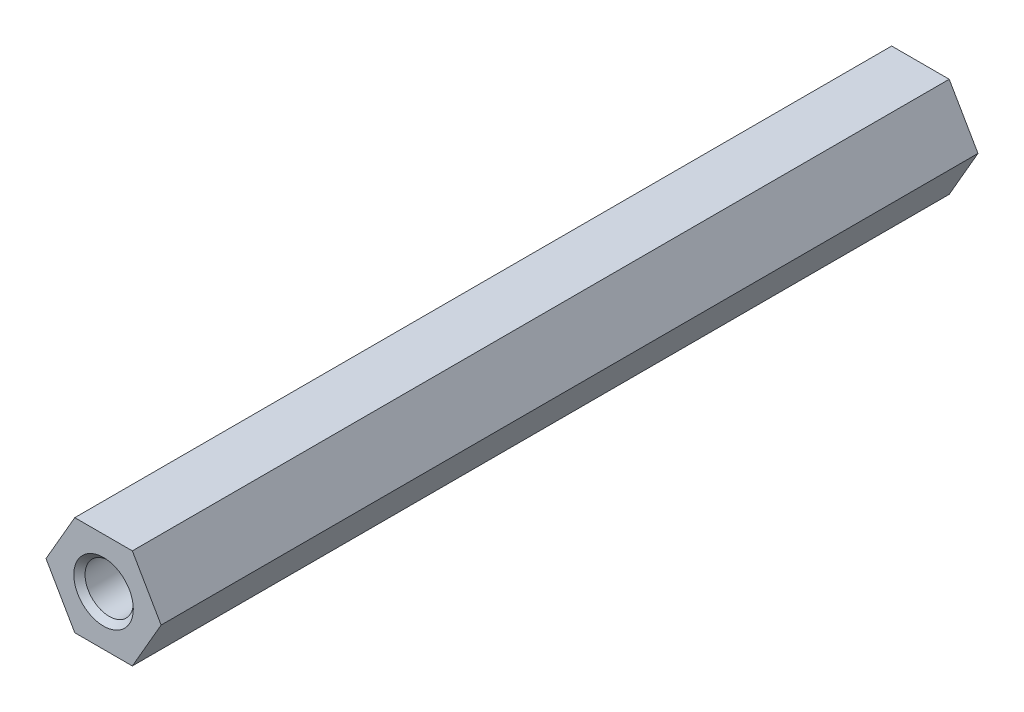
ISO-10303-21;
HEADER;
FILE_DESCRIPTION(('STEP AP214'),'2;1');
FILE_NAME('part.step','',(''),(''),'','','');
FILE_SCHEMA(('AUTOMOTIVE_DESIGN { 1 0 10303 214 1 1 1 1 }'));
ENDSEC;
DATA;
#1=APPLICATION_CONTEXT('core data for automotive mechanical design processes');
#2=APPLICATION_PROTOCOL_DEFINITION('international standard','automotive_design',2000,#1);
#3=PRODUCT_CONTEXT('',#1,'mechanical');
#4=PRODUCT('Part','Part','',(#3));
#5=PRODUCT_RELATED_PRODUCT_CATEGORY('part','',(#4));
#6=PRODUCT_DEFINITION_FORMATION('','',#4);
#7=PRODUCT_DEFINITION_CONTEXT('part definition',#1,'design');
#8=PRODUCT_DEFINITION('design','',#6,#7);
#9=PRODUCT_DEFINITION_SHAPE('','',#8);
#10=(LENGTH_UNIT() NAMED_UNIT(*) SI_UNIT(.MILLI.,.METRE.));
#11=(NAMED_UNIT(*) PLANE_ANGLE_UNIT() SI_UNIT($,.RADIAN.));
#12=(NAMED_UNIT(*) SI_UNIT($,.STERADIAN.) SOLID_ANGLE_UNIT());
#13=UNCERTAINTY_MEASURE_WITH_UNIT(LENGTH_MEASURE(1.E-05),#10,'distance_accuracy_value','');
#14=(GEOMETRIC_REPRESENTATION_CONTEXT(3) GLOBAL_UNCERTAINTY_ASSIGNED_CONTEXT((#13)) GLOBAL_UNIT_ASSIGNED_CONTEXT((#10,
#11,#12)) REPRESENTATION_CONTEXT('',''));
#15=CARTESIAN_POINT('',(0.,0.,0.));
#16=DIRECTION('',(0.,0.,1.));
#17=DIRECTION('',(1.,0.,0.));
#18=AXIS2_PLACEMENT_3D('',#15,#16,#17);
#19=CARTESIAN_POINT('',(-1.78978583448784,-3.1,0.));
#20=DIRECTION('',(0.,-1.,0.));
#21=DIRECTION('',(0.,0.,-1.));
#22=AXIS2_PLACEMENT_3D('',#19,#20,#21);
#23=PLANE('',#22);
#24=DIRECTION('',(0.,0.,1.));
#25=VECTOR('',#24,1.);
#26=CARTESIAN_POINT('',(-1.78978583448784,-3.1,0.));
#27=LINE('',#26,#25);
#28=CARTESIAN_POINT('',(-1.78978583448784,-3.1,0.));
#29=VERTEX_POINT('',#28);
#30=CARTESIAN_POINT('',(-1.78978583448784,-3.1,50.8));
#31=VERTEX_POINT('',#30);
#32=EDGE_CURVE('E100',#29,#31,#27,.T.);
#33=ORIENTED_EDGE('',*,*,#32,.F.);
#34=DIRECTION('',(1.,0.,0.));
#35=VECTOR('',#34,1.);
#36=CARTESIAN_POINT('',(0.,-3.1,0.));
#37=LINE('',#36,#35);
#38=CARTESIAN_POINT('',(1.78978583448784,-3.1,0.));
#39=VERTEX_POINT('',#38);
#40=EDGE_CURVE('E126',#29,#39,#37,.T.);
#41=ORIENTED_EDGE('',*,*,#40,.T.);
#42=DIRECTION('',(0.,0.,1.));
#43=VECTOR('',#42,1.);
#44=CARTESIAN_POINT('',(1.78978583448784,-3.1,0.));
#45=LINE('',#44,#43);
#46=CARTESIAN_POINT('',(1.78978583448784,-3.1,50.8));
#47=VERTEX_POINT('',#46);
#48=EDGE_CURVE('E66',#47,#39,#45,.F.);
#49=ORIENTED_EDGE('',*,*,#48,.F.);
#50=DIRECTION('',(1.,0.,0.));
#51=VECTOR('',#50,1.);
#52=CARTESIAN_POINT('',(0.,-3.1,50.8));
#53=LINE('',#52,#51);
#54=EDGE_CURVE('E78',#31,#47,#53,.T.);
#55=ORIENTED_EDGE('',*,*,#54,.F.);
#56=EDGE_LOOP('',(#33,#41,#49,#55));
#57=FACE_BOUND('',#56,.T.);
#58=ADVANCED_FACE('F15',(#57),#23,.T.);
#59=CARTESIAN_POINT('',(1.78978583448784,-3.1,0.));
#60=DIRECTION('',(0.866025403784439,-0.5,0.));
#61=DIRECTION('',(0.5,0.866025403784439,0.));
#62=AXIS2_PLACEMENT_3D('',#59,#60,#61);
#63=PLANE('',#62);
#64=ORIENTED_EDGE('',*,*,#48,.T.);
#65=DIRECTION('',(0.5,0.866025403784439,0.));
#66=VECTOR('',#65,1.);
#67=CARTESIAN_POINT('',(1.78978583448784,-3.1,0.));
#68=LINE('',#67,#66);
#69=CARTESIAN_POINT('',(3.57957166897568,0.,0.));
#70=VERTEX_POINT('',#69);
#71=EDGE_CURVE('E85',#39,#70,#68,.T.);
#72=ORIENTED_EDGE('',*,*,#71,.T.);
#73=DIRECTION('',(0.,0.,1.));
#74=VECTOR('',#73,1.);
#75=CARTESIAN_POINT('',(3.57957166897568,0.,0.));
#76=LINE('',#75,#74);
#77=CARTESIAN_POINT('',(3.57957166897568,0.,50.8));
#78=VERTEX_POINT('',#77);
#79=EDGE_CURVE('E82',#78,#70,#76,.F.);
#80=ORIENTED_EDGE('',*,*,#79,.F.);
#81=DIRECTION('',(0.5,0.866025403784439,0.));
#82=VECTOR('',#81,1.);
#83=CARTESIAN_POINT('',(1.78978583448784,-3.1,50.8));
#84=LINE('',#83,#82);
#85=EDGE_CURVE('E71',#47,#78,#84,.T.);
#86=ORIENTED_EDGE('',*,*,#85,.F.);
#87=EDGE_LOOP('',(#64,#72,#80,#86));
#88=FACE_BOUND('',#87,.T.);
#89=ADVANCED_FACE('F83',(#88),#63,.T.);
#90=CARTESIAN_POINT('',(3.57957166897568,0.,0.));
#91=DIRECTION('',(0.866025403784439,0.5,0.));
#92=DIRECTION('',(-0.5,0.866025403784439,0.));
#93=AXIS2_PLACEMENT_3D('',#90,#91,#92);
#94=PLANE('',#93);
#95=ORIENTED_EDGE('',*,*,#79,.T.);
#96=DIRECTION('',(-0.5,0.866025403784438,0.));
#97=VECTOR('',#96,1.);
#98=CARTESIAN_POINT('',(3.57957166897568,0.,0.));
#99=LINE('',#98,#97);
#100=CARTESIAN_POINT('',(1.78978583448784,3.1,0.));
#101=VERTEX_POINT('',#100);
#102=EDGE_CURVE('E123',#70,#101,#99,.T.);
#103=ORIENTED_EDGE('',*,*,#102,.T.);
#104=DIRECTION('',(0.,0.,1.));
#105=VECTOR('',#104,1.);
#106=CARTESIAN_POINT('',(1.78978583448784,3.1,0.));
#107=LINE('',#106,#105);
#108=CARTESIAN_POINT('',(1.78978583448784,3.1,50.8));
#109=VERTEX_POINT('',#108);
#110=EDGE_CURVE('E89',#109,#101,#107,.F.);
#111=ORIENTED_EDGE('',*,*,#110,.F.);
#112=DIRECTION('',(-0.5,0.866025403784438,0.));
#113=VECTOR('',#112,1.);
#114=CARTESIAN_POINT('',(3.57957166897568,0.,50.8));
#115=LINE('',#114,#113);
#116=EDGE_CURVE('E76',#78,#109,#115,.T.);
#117=ORIENTED_EDGE('',*,*,#116,.F.);
#118=EDGE_LOOP('',(#95,#103,#111,#117));
#119=FACE_BOUND('',#118,.T.);
#120=ADVANCED_FACE('F91',(#119),#94,.T.);
#121=CARTESIAN_POINT('',(1.78978583448784,3.1,0.));
#122=DIRECTION('',(0.,1.,0.));
#123=DIRECTION('',(0.,0.,1.));
#124=AXIS2_PLACEMENT_3D('',#121,#122,#123);
#125=PLANE('',#124);
#126=ORIENTED_EDGE('',*,*,#110,.T.);
#127=DIRECTION('',(1.,0.,0.));
#128=VECTOR('',#127,1.);
#129=CARTESIAN_POINT('',(0.,3.1,0.));
#130=LINE('',#129,#128);
#131=CARTESIAN_POINT('',(-1.78978583448784,3.1,0.));
#132=VERTEX_POINT('',#131);
#133=EDGE_CURVE('E118',#101,#132,#130,.F.);
#134=ORIENTED_EDGE('',*,*,#133,.T.);
#135=DIRECTION('',(0.,0.,1.));
#136=VECTOR('',#135,1.);
#137=CARTESIAN_POINT('',(-1.78978583448784,3.1,0.));
#138=LINE('',#137,#136);
#139=CARTESIAN_POINT('',(-1.78978583448784,3.1,50.8));
#140=VERTEX_POINT('',#139);
#141=EDGE_CURVE('E102',#140,#132,#138,.F.);
#142=ORIENTED_EDGE('',*,*,#141,.F.);
#143=DIRECTION('',(1.,0.,0.));
#144=VECTOR('',#143,1.);
#145=CARTESIAN_POINT('',(0.,3.1,50.8));
#146=LINE('',#145,#144);
#147=EDGE_CURVE('E93',#109,#140,#146,.F.);
#148=ORIENTED_EDGE('',*,*,#147,.F.);
#149=EDGE_LOOP('',(#126,#134,#142,#148));
#150=FACE_BOUND('',#149,.T.);
#151=ADVANCED_FACE('F141',(#150),#125,.T.);
#152=CARTESIAN_POINT('',(-1.78978583448784,3.1,0.));
#153=DIRECTION('',(-0.866025403784439,0.5,0.));
#154=DIRECTION('',(-0.5,-0.866025403784439,0.));
#155=AXIS2_PLACEMENT_3D('',#152,#153,#154);
#156=PLANE('',#155);
#157=ORIENTED_EDGE('',*,*,#141,.T.);
#158=DIRECTION('',(-0.5,-0.866025403784439,0.));
#159=VECTOR('',#158,1.);
#160=CARTESIAN_POINT('',(-1.78978583448784,3.1,0.));
#161=LINE('',#160,#159);
#162=CARTESIAN_POINT('',(-3.57957166897568,0.,0.));
#163=VERTEX_POINT('',#162);
#164=EDGE_CURVE('E115',#132,#163,#161,.T.);
#165=ORIENTED_EDGE('',*,*,#164,.T.);
#166=DIRECTION('',(0.,0.,1.));
#167=VECTOR('',#166,1.);
#168=CARTESIAN_POINT('',(-3.57957166897568,0.,0.));
#169=LINE('',#168,#167);
#170=CARTESIAN_POINT('',(-3.57957166897568,0.,50.8));
#171=VERTEX_POINT('',#170);
#172=EDGE_CURVE('E33',#171,#163,#169,.F.);
#173=ORIENTED_EDGE('',*,*,#172,.F.);
#174=DIRECTION('',(-0.5,-0.866025403784439,0.));
#175=VECTOR('',#174,1.);
#176=CARTESIAN_POINT('',(-1.78978583448784,3.1,50.8));
#177=LINE('',#176,#175);
#178=EDGE_CURVE('E95',#140,#171,#177,.T.);
#179=ORIENTED_EDGE('',*,*,#178,.F.);
#180=EDGE_LOOP('',(#157,#165,#173,#179));
#181=FACE_BOUND('',#180,.T.);
#182=ADVANCED_FACE('F133',(#181),#156,.T.);
#183=CARTESIAN_POINT('',(-3.57957166897568,0.,0.));
#184=DIRECTION('',(-0.866025403784439,-0.5,0.));
#185=DIRECTION('',(0.5,-0.866025403784439,0.));
#186=AXIS2_PLACEMENT_3D('',#183,#184,#185);
#187=PLANE('',#186);
#188=ORIENTED_EDGE('',*,*,#172,.T.);
#189=DIRECTION('',(0.5,-0.866025403784438,0.));
#190=VECTOR('',#189,1.);
#191=CARTESIAN_POINT('',(-3.57957166897568,0.,0.));
#192=LINE('',#191,#190);
#193=EDGE_CURVE('E112',#163,#29,#192,.T.);
#194=ORIENTED_EDGE('',*,*,#193,.T.);
#195=ORIENTED_EDGE('',*,*,#32,.T.);
#196=DIRECTION('',(0.5,-0.866025403784438,0.));
#197=VECTOR('',#196,1.);
#198=CARTESIAN_POINT('',(-3.57957166897568,0.,50.8));
#199=LINE('',#198,#197);
#200=EDGE_CURVE('E129',#171,#31,#199,.T.);
#201=ORIENTED_EDGE('',*,*,#200,.F.);
#202=EDGE_LOOP('',(#188,#194,#195,#201));
#203=FACE_BOUND('',#202,.T.);
#204=ADVANCED_FACE('F135',(#203),#187,.T.);
#205=CARTESIAN_POINT('',(0.,0.,50.8));
#206=DIRECTION('',(0.,0.,1.));
#207=DIRECTION('',(1.,0.,0.));
#208=AXIS2_PLACEMENT_3D('',#205,#206,#207);
#209=PLANE('',#208);
#210=CARTESIAN_POINT('',(0.,0.,50.7999999900619));
#211=DIRECTION('',(0.,0.,1.));
#212=DIRECTION('',(1.,0.,0.));
#213=AXIS2_PLACEMENT_3D('',#210,#211,#212);
#214=CIRCLE('',#213,1.84999999001436);
#215=CARTESIAN_POINT('',(1.84999999001438,0.,50.7999999900619));
#216=VERTEX_POINT('',#215);
#217=EDGE_CURVE('E18',#216,#216,#214,.F.);
#218=ORIENTED_EDGE('',*,*,#217,.T.);
#219=EDGE_LOOP('',(#218));
#220=FACE_BOUND('',#219,.T.);
#221=ORIENTED_EDGE('',*,*,#200,.T.);
#222=ORIENTED_EDGE('',*,*,#54,.T.);
#223=ORIENTED_EDGE('',*,*,#85,.T.);
#224=ORIENTED_EDGE('',*,*,#116,.T.);
#225=ORIENTED_EDGE('',*,*,#147,.T.);
#226=ORIENTED_EDGE('',*,*,#178,.T.);
#227=EDGE_LOOP('',(#221,#222,#223,#224,#225,#226));
#228=FACE_BOUND('',#227,.T.);
#229=ADVANCED_FACE('F74',(#220,#228),#209,.T.);
#230=CARTESIAN_POINT('',(0.,0.,0.));
#231=DIRECTION('',(0.,0.,1.));
#232=DIRECTION('',(1.,0.,0.));
#233=AXIS2_PLACEMENT_3D('',#230,#231,#232);
#234=PLANE('',#233);
#235=CARTESIAN_POINT('',(0.,0.,1.19371179607697E-08));
#236=DIRECTION('',(0.,0.,-1.));
#237=DIRECTION('',(-1.,0.,0.));
#238=AXIS2_PLACEMENT_3D('',#235,#236,#237);
#239=CIRCLE('',#238,1.84999998805324);
#240=CARTESIAN_POINT('',(-1.84999998805324,0.,1.19371179607697E-08));
#241=VERTEX_POINT('',#240);
#242=EDGE_CURVE('E105',#241,#241,#239,.F.);
#243=ORIENTED_EDGE('',*,*,#242,.T.);
#244=EDGE_LOOP('',(#243));
#245=FACE_BOUND('',#244,.T.);
#246=ORIENTED_EDGE('',*,*,#164,.F.);
#247=ORIENTED_EDGE('',*,*,#133,.F.);
#248=ORIENTED_EDGE('',*,*,#102,.F.);
#249=ORIENTED_EDGE('',*,*,#71,.F.);
#250=ORIENTED_EDGE('',*,*,#40,.F.);
#251=ORIENTED_EDGE('',*,*,#193,.F.);
#252=EDGE_LOOP('',(#246,#247,#248,#249,#250,#251));
#253=FACE_BOUND('',#252,.T.);
#254=ADVANCED_FACE('F138',(#245,#253),#234,.F.);
#255=CARTESIAN_POINT('',(0.,0.,50.7999999899766));
#256=DIRECTION('',(0.,0.,1.));
#257=DIRECTION('',(1.,0.,0.));
#258=AXIS2_PLACEMENT_3D('',#255,#256,#257);
#259=CONICAL_SURFACE('',#258,1.84999998992907,0.785398163478653);
#260=CARTESIAN_POINT('',(0.,0.,50.45));
#261=DIRECTION('',(0.,0.,-1.));
#262=DIRECTION('',(-1.,0.,0.));
#263=AXIS2_PLACEMENT_3D('',#260,#261,#262);
#264=CIRCLE('',#263,1.5);
#265=CARTESIAN_POINT('',(-1.5,0.,50.45));
#266=VERTEX_POINT('',#265);
#267=EDGE_CURVE('E24',#266,#266,#264,.T.);
#268=ORIENTED_EDGE('',*,*,#267,.T.);
#269=EDGE_LOOP('',(#268));
#270=FACE_BOUND('',#269,.T.);
#271=ORIENTED_EDGE('',*,*,#217,.F.);
#272=EDGE_LOOP('',(#271));
#273=FACE_BOUND('',#272,.T.);
#274=ADVANCED_FACE('F159',(#270,#273),#259,.F.);
#275=CARTESIAN_POINT('',(0.,0.,1.19939613796305E-08));
#276=DIRECTION('',(0.,0.,-1.));
#277=DIRECTION('',(-1.,0.,0.));
#278=AXIS2_PLACEMENT_3D('',#275,#276,#277);
#279=CONICAL_SURFACE('',#278,1.8499999879964,0.785398163397448);
#280=CARTESIAN_POINT('',(0.,0.,0.350000000000003));
#281=DIRECTION('',(0.,0.,-1.));
#282=DIRECTION('',(-1.,0.,0.));
#283=AXIS2_PLACEMENT_3D('',#280,#281,#282);
#284=CIRCLE('',#283,1.5);
#285=CARTESIAN_POINT('',(-1.5,0.,0.350000000000003));
#286=VERTEX_POINT('',#285);
#287=EDGE_CURVE('E10',#286,#286,#284,.F.);
#288=ORIENTED_EDGE('',*,*,#287,.T.);
#289=EDGE_LOOP('',(#288));
#290=FACE_BOUND('',#289,.T.);
#291=ORIENTED_EDGE('',*,*,#242,.F.);
#292=EDGE_LOOP('',(#291));
#293=FACE_BOUND('',#292,.T.);
#294=ADVANCED_FACE('F153',(#290,#293),#279,.F.);
#295=CARTESIAN_POINT('',(0.,0.,50.8));
#296=DIRECTION('',(0.,0.,-1.));
#297=DIRECTION('',(-1.,0.,0.));
#298=AXIS2_PLACEMENT_3D('',#295,#296,#297);
#299=CYLINDRICAL_SURFACE('',#298,1.5);
#300=ORIENTED_EDGE('',*,*,#287,.F.);
#301=EDGE_LOOP('',(#300));
#302=FACE_BOUND('',#301,.T.);
#303=ORIENTED_EDGE('',*,*,#267,.F.);
#304=EDGE_LOOP('',(#303));
#305=FACE_BOUND('',#304,.T.);
#306=ADVANCED_FACE('F151',(#302,#305),#299,.F.);
#307=CLOSED_SHELL('',(#58,#89,#120,#151,#182,#204,#229,#254,#274,#294,#306));
#308=MANIFOLD_SOLID_BREP('B1',#307);
#309=ADVANCED_BREP_SHAPE_REPRESENTATION('',(#18,#308),#14);
#310=SHAPE_DEFINITION_REPRESENTATION(#9,#309);
ENDSEC;
END-ISO-10303-21;
